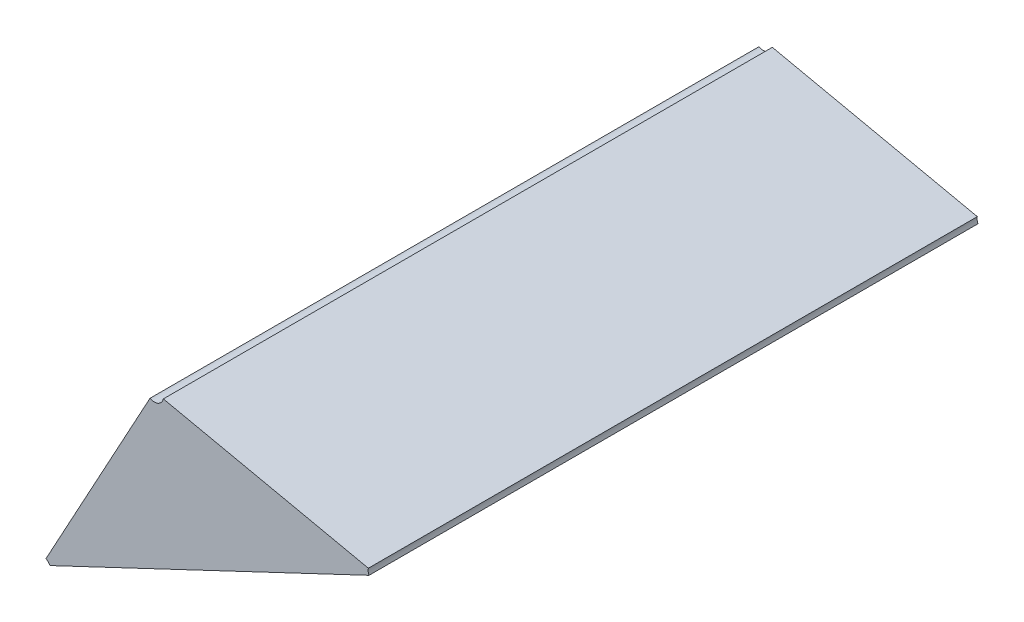
ISO-10303-21;
HEADER;
FILE_DESCRIPTION(('STEP AP214'),'2;1');
FILE_NAME('part.step','',(''),(''),'','','');
FILE_SCHEMA(('AUTOMOTIVE_DESIGN { 1 0 10303 214 1 1 1 1 }'));
ENDSEC;
DATA;
#1=APPLICATION_CONTEXT('core data for automotive mechanical design processes');
#2=APPLICATION_PROTOCOL_DEFINITION('international standard','automotive_design',2000,#1);
#3=PRODUCT_CONTEXT('',#1,'mechanical');
#4=PRODUCT('Part','Part','',(#3));
#5=PRODUCT_RELATED_PRODUCT_CATEGORY('part','',(#4));
#6=PRODUCT_DEFINITION_FORMATION('','',#4);
#7=PRODUCT_DEFINITION_CONTEXT('part definition',#1,'design');
#8=PRODUCT_DEFINITION('design','',#6,#7);
#9=PRODUCT_DEFINITION_SHAPE('','',#8);
#10=(LENGTH_UNIT() NAMED_UNIT(*) SI_UNIT(.MILLI.,.METRE.));
#11=(NAMED_UNIT(*) PLANE_ANGLE_UNIT() SI_UNIT($,.RADIAN.));
#12=(NAMED_UNIT(*) SI_UNIT($,.STERADIAN.) SOLID_ANGLE_UNIT());
#13=UNCERTAINTY_MEASURE_WITH_UNIT(LENGTH_MEASURE(1.E-05),#10,'distance_accuracy_value','');
#14=(GEOMETRIC_REPRESENTATION_CONTEXT(3) GLOBAL_UNCERTAINTY_ASSIGNED_CONTEXT((#13)) GLOBAL_UNIT_ASSIGNED_CONTEXT((#10,
#11,#12)) REPRESENTATION_CONTEXT('',''));
#15=CARTESIAN_POINT('',(0.,0.,0.));
#16=DIRECTION('',(0.,0.,1.));
#17=DIRECTION('',(1.,0.,0.));
#18=AXIS2_PLACEMENT_3D('',#15,#16,#17);
#19=CARTESIAN_POINT('',(-0.871804418110991,-0.778912469373211,0.1));
#20=DIRECTION('',(0.,0.,1.));
#21=DIRECTION('',(-1.,0.,0.));
#22=AXIS2_PLACEMENT_3D('',#19,#20,#21);
#23=CYLINDRICAL_SURFACE('',#22,0.0015);
#24=DIRECTION('',(0.,0.,-1.));
#25=VECTOR('',#24,1.);
#26=CARTESIAN_POINT('',(-0.872522300703165,-0.780229528439409,0.1));
#27=LINE('',#26,#25);
#28=CARTESIAN_POINT('',(-0.872522300703165,-0.780229528439409,0.1));
#29=VERTEX_POINT('',#28);
#30=CARTESIAN_POINT('',(-0.872522300703165,-0.780229528439409,0.));
#31=VERTEX_POINT('',#30);
#32=EDGE_CURVE('E11',#29,#31,#27,.T.);
#33=ORIENTED_EDGE('',*,*,#32,.F.);
#34=CARTESIAN_POINT('',(-0.871804418110991,-0.778912469373211,0.1));
#35=DIRECTION('',(0.,0.,-1.));
#36=DIRECTION('',(0.977619939969148,-0.210378832049996,0.));
#37=AXIS2_PLACEMENT_3D('',#34,#35,#36);
#38=CIRCLE('',#37,0.0015);
#39=CARTESIAN_POINT('',(-0.870337988201037,-0.779228037621286,0.1));
#40=VERTEX_POINT('',#39);
#41=EDGE_CURVE('E72',#40,#29,#38,.T.);
#42=ORIENTED_EDGE('',*,*,#41,.F.);
#43=DIRECTION('',(0.,0.,1.));
#44=VECTOR('',#43,1.);
#45=CARTESIAN_POINT('',(-0.870337988201037,-0.779228037621286,0.));
#46=LINE('',#45,#44);
#47=CARTESIAN_POINT('',(-0.870337988201037,-0.779228037621286,0.));
#48=VERTEX_POINT('',#47);
#49=EDGE_CURVE('E94',#48,#40,#46,.T.);
#50=ORIENTED_EDGE('',*,*,#49,.F.);
#51=CARTESIAN_POINT('',(-0.871804418110991,-0.778912469373211,0.));
#52=DIRECTION('',(0.,0.,1.));
#53=DIRECTION('',(-0.478588394782648,-0.878039377465139,0.));
#54=AXIS2_PLACEMENT_3D('',#51,#52,#53);
#55=CIRCLE('',#54,0.0015);
#56=EDGE_CURVE('E109',#31,#48,#55,.T.);
#57=ORIENTED_EDGE('',*,*,#56,.F.);
#58=EDGE_LOOP('',(#33,#42,#50,#57));
#59=FACE_BOUND('',#58,.T.);
#60=ADVANCED_FACE('F17',(#59),#23,.F.);
#61=CARTESIAN_POINT('',(-0.835202983834856,-0.786788911617844,0.1));
#62=DIRECTION('',(0.,0.,1.));
#63=DIRECTION('',(-1.,0.,0.));
#64=AXIS2_PLACEMENT_3D('',#61,#62,#63);
#65=CYLINDRICAL_SURFACE('',#64,0.0015);
#66=DIRECTION('',(0.,0.,-1.));
#67=VECTOR('',#66,1.);
#68=CARTESIAN_POINT('',(-0.83666941374481,-0.786473343369769,0.1));
#69=LINE('',#68,#67);
#70=CARTESIAN_POINT('',(-0.83666941374481,-0.786473343369769,0.1));
#71=VERTEX_POINT('',#70);
#72=CARTESIAN_POINT('',(-0.83666941374481,-0.786473343369769,0.));
#73=VERTEX_POINT('',#72);
#74=EDGE_CURVE('E24',#71,#73,#69,.T.);
#75=ORIENTED_EDGE('',*,*,#74,.F.);
#76=CARTESIAN_POINT('',(-0.835202983834856,-0.786788911617844,0.1));
#77=DIRECTION('',(0.,0.,-1.));
#78=DIRECTION('',(-0.903806397975998,-0.427941578930643,0.));
#79=AXIS2_PLACEMENT_3D('',#76,#77,#78);
#80=CIRCLE('',#79,0.0015);
#81=CARTESIAN_POINT('',(-0.83655869343182,-0.78743082398624,0.1));
#82=VERTEX_POINT('',#81);
#83=EDGE_CURVE('E90',#82,#71,#80,.T.);
#84=ORIENTED_EDGE('',*,*,#83,.F.);
#85=DIRECTION('',(0.,0.,1.));
#86=VECTOR('',#85,1.);
#87=CARTESIAN_POINT('',(-0.83655869343182,-0.78743082398624,0.));
#88=LINE('',#87,#86);
#89=CARTESIAN_POINT('',(-0.83655869343182,-0.78743082398624,0.));
#90=VERTEX_POINT('',#89);
#91=EDGE_CURVE('E120',#90,#82,#88,.T.);
#92=ORIENTED_EDGE('',*,*,#91,.F.);
#93=CARTESIAN_POINT('',(-0.835202983834856,-0.786788911617844,0.));
#94=DIRECTION('',(0.,0.,1.));
#95=DIRECTION('',(-0.977619939969148,0.210378832049996,0.));
#96=AXIS2_PLACEMENT_3D('',#93,#94,#95);
#97=CIRCLE('',#96,0.0015);
#98=EDGE_CURVE('E75',#73,#90,#97,.T.);
#99=ORIENTED_EDGE('',*,*,#98,.F.);
#100=EDGE_LOOP('',(#75,#84,#92,#99));
#101=FACE_BOUND('',#100,.T.);
#102=ADVANCED_FACE('F124',(#101),#65,.F.);
#103=CARTESIAN_POINT('',(-0.890323078724941,-0.812887620911013,0.1));
#104=DIRECTION('',(0.,0.,1.));
#105=DIRECTION('',(-1.,0.,0.));
#106=AXIS2_PLACEMENT_3D('',#103,#104,#105);
#107=CYLINDRICAL_SURFACE('',#106,0.0015);
#108=DIRECTION('',(0.,0.,1.));
#109=VECTOR('',#108,1.);
#110=CARTESIAN_POINT('',(-0.889605196132768,-0.811570561844815,0.));
#111=LINE('',#110,#109);
#112=CARTESIAN_POINT('',(-0.889605196132768,-0.811570561844815,0.));
#113=VERTEX_POINT('',#112);
#114=CARTESIAN_POINT('',(-0.889605196132768,-0.811570561844815,0.1));
#115=VERTEX_POINT('',#114);
#116=EDGE_CURVE('E79',#113,#115,#111,.T.);
#117=ORIENTED_EDGE('',*,*,#116,.F.);
#118=CARTESIAN_POINT('',(-0.890323078724941,-0.812887620911013,0.));
#119=DIRECTION('',(0.,0.,1.));
#120=DIRECTION('',(0.903806397975728,0.427941578931212,0.));
#121=AXIS2_PLACEMENT_3D('',#118,#119,#120);
#122=CIRCLE('',#121,0.0015);
#123=CARTESIAN_POINT('',(-0.888967369127977,-0.812245708542616,0.));
#124=VERTEX_POINT('',#123);
#125=EDGE_CURVE('E123',#124,#113,#122,.T.);
#126=ORIENTED_EDGE('',*,*,#125,.F.);
#127=DIRECTION('',(0.,0.,-1.));
#128=VECTOR('',#127,1.);
#129=CARTESIAN_POINT('',(-0.888967369127977,-0.812245708542616,0.1));
#130=LINE('',#129,#128);
#131=CARTESIAN_POINT('',(-0.888967369127977,-0.812245708542616,0.1));
#132=VERTEX_POINT('',#131);
#133=EDGE_CURVE('E82',#132,#124,#130,.T.);
#134=ORIENTED_EDGE('',*,*,#133,.F.);
#135=CARTESIAN_POINT('',(-0.890323078724941,-0.812887620911013,0.1));
#136=DIRECTION('',(0.,0.,-1.));
#137=DIRECTION('',(0.478588394782067,0.878039377465455,0.));
#138=AXIS2_PLACEMENT_3D('',#135,#136,#137);
#139=CIRCLE('',#138,0.0015);
#140=EDGE_CURVE('E70',#115,#132,#139,.T.);
#141=ORIENTED_EDGE('',*,*,#140,.F.);
#142=EDGE_LOOP('',(#117,#126,#134,#141));
#143=FACE_BOUND('',#142,.T.);
#144=ADVANCED_FACE('F78',(#143),#107,.F.);
#145=CARTESIAN_POINT('',(-0.871804418110991,-0.778912469373211,0.));
#146=DIRECTION('',(-0.210378832050012,-0.977619939969144,0.));
#147=DIRECTION('',(0.977619939969144,-0.210378832050012,0.));
#148=AXIS2_PLACEMENT_3D('',#145,#146,#147);
#149=PLANE('',#148);
#150=ORIENTED_EDGE('',*,*,#49,.T.);
#151=DIRECTION('',(0.977619939969144,-0.210378832050013,0.));
#152=VECTOR('',#151,1.);
#153=CARTESIAN_POINT('',(-0.870337988201037,-0.779228037621286,0.1));
#154=LINE('',#153,#152);
#155=EDGE_CURVE('E104',#40,#71,#154,.T.);
#156=ORIENTED_EDGE('',*,*,#155,.T.);
#157=ORIENTED_EDGE('',*,*,#74,.T.);
#158=DIRECTION('',(0.977619939969144,-0.210378832050013,0.));
#159=VECTOR('',#158,1.);
#160=CARTESIAN_POINT('',(-0.870337988201037,-0.779228037621286,0.));
#161=LINE('',#160,#159);
#162=EDGE_CURVE('E102',#48,#73,#161,.T.);
#163=ORIENTED_EDGE('',*,*,#162,.F.);
#164=EDGE_LOOP('',(#150,#156,#157,#163));
#165=FACE_BOUND('',#164,.T.);
#166=ADVANCED_FACE('F101',(#165),#149,.F.);
#167=CARTESIAN_POINT('',(-0.865399191276997,-0.794088640671192,0.1));
#168=DIRECTION('',(0.,0.,-1.));
#169=DIRECTION('',(-1.,0.,0.));
#170=AXIS2_PLACEMENT_3D('',#167,#168,#169);
#171=PLANE('',#170);
#172=ORIENTED_EDGE('',*,*,#41,.T.);
#173=DIRECTION('',(0.478588394782364,0.878039377465294,0.));
#174=VECTOR('',#173,1.);
#175=CARTESIAN_POINT('',(-0.889605196132767,-0.811570561844815,0.1));
#176=LINE('',#175,#174);
#177=EDGE_CURVE('E66',#115,#29,#176,.T.);
#178=ORIENTED_EDGE('',*,*,#177,.F.);
#179=ORIENTED_EDGE('',*,*,#140,.T.);
#180=DIRECTION('',(-0.903806397975918,-0.427941578930812,0.));
#181=VECTOR('',#180,1.);
#182=CARTESIAN_POINT('',(-0.83655869343182,-0.78743082398624,0.1));
#183=LINE('',#182,#181);
#184=EDGE_CURVE('E84',#82,#132,#183,.T.);
#185=ORIENTED_EDGE('',*,*,#184,.F.);
#186=ORIENTED_EDGE('',*,*,#83,.T.);
#187=ORIENTED_EDGE('',*,*,#155,.F.);
#188=EDGE_LOOP('',(#172,#178,#179,#185,#186,#187));
#189=FACE_BOUND('',#188,.T.);
#190=ADVANCED_FACE('F68',(#189),#171,.F.);
#191=CARTESIAN_POINT('',(-0.835202983834856,-0.786788911617844,0.));
#192=DIRECTION('',(-0.427941578930812,0.903806397975918,0.));
#193=DIRECTION('',(-0.903806397975918,-0.427941578930812,0.));
#194=AXIS2_PLACEMENT_3D('',#191,#192,#193);
#195=PLANE('',#194);
#196=ORIENTED_EDGE('',*,*,#91,.T.);
#197=ORIENTED_EDGE('',*,*,#184,.T.);
#198=ORIENTED_EDGE('',*,*,#133,.T.);
#199=DIRECTION('',(-0.903806397975918,-0.427941578930812,0.));
#200=VECTOR('',#199,1.);
#201=CARTESIAN_POINT('',(-0.83655869343182,-0.78743082398624,0.));
#202=LINE('',#201,#200);
#203=EDGE_CURVE('E112',#90,#124,#202,.T.);
#204=ORIENTED_EDGE('',*,*,#203,.F.);
#205=EDGE_LOOP('',(#196,#197,#198,#204));
#206=FACE_BOUND('',#205,.T.);
#207=ADVANCED_FACE('F127',(#206),#195,.F.);
#208=CARTESIAN_POINT('',(-0.890323078724941,-0.812887620911013,0.));
#209=DIRECTION('',(0.878039377465292,-0.478588394782367,0.));
#210=DIRECTION('',(0.478588394782367,0.878039377465292,0.));
#211=AXIS2_PLACEMENT_3D('',#208,#209,#210);
#212=PLANE('',#211);
#213=ORIENTED_EDGE('',*,*,#32,.T.);
#214=DIRECTION('',(0.478588394782364,0.878039377465294,0.));
#215=VECTOR('',#214,1.);
#216=CARTESIAN_POINT('',(-0.889605196132767,-0.811570561844815,0.));
#217=LINE('',#216,#215);
#218=EDGE_CURVE('E88',#113,#31,#217,.T.);
#219=ORIENTED_EDGE('',*,*,#218,.F.);
#220=ORIENTED_EDGE('',*,*,#116,.T.);
#221=ORIENTED_EDGE('',*,*,#177,.T.);
#222=EDGE_LOOP('',(#213,#219,#220,#221));
#223=FACE_BOUND('',#222,.T.);
#224=ADVANCED_FACE('F86',(#223),#212,.F.);
#225=CARTESIAN_POINT('',(-0.865399191276997,-0.794088640671192,0.));
#226=DIRECTION('',(0.,0.,-1.));
#227=DIRECTION('',(-1.,0.,0.));
#228=AXIS2_PLACEMENT_3D('',#225,#226,#227);
#229=PLANE('',#228);
#230=ORIENTED_EDGE('',*,*,#56,.T.);
#231=ORIENTED_EDGE('',*,*,#162,.T.);
#232=ORIENTED_EDGE('',*,*,#98,.T.);
#233=ORIENTED_EDGE('',*,*,#203,.T.);
#234=ORIENTED_EDGE('',*,*,#125,.T.);
#235=ORIENTED_EDGE('',*,*,#218,.T.);
#236=EDGE_LOOP('',(#230,#231,#232,#233,#234,#235));
#237=FACE_BOUND('',#236,.T.);
#238=ADVANCED_FACE('F107',(#237),#229,.T.);
#239=CLOSED_SHELL('',(#60,#102,#144,#166,#190,#207,#224,#238));
#240=MANIFOLD_SOLID_BREP('B1',#239);
#241=ADVANCED_BREP_SHAPE_REPRESENTATION('',(#18,#240),#14);
#242=SHAPE_DEFINITION_REPRESENTATION(#9,#241);
ENDSEC;
END-ISO-10303-21;
